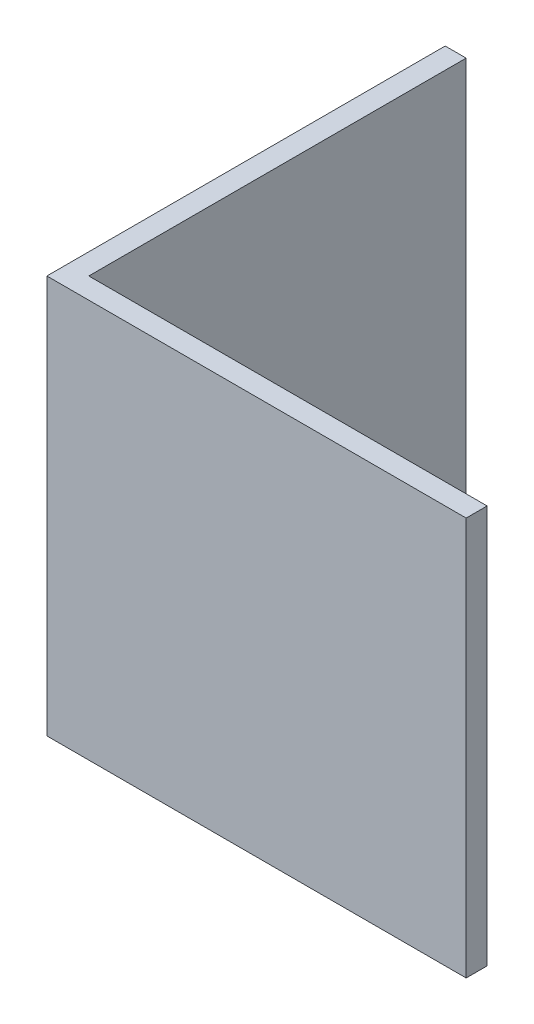
ISO-10303-21;
HEADER;
FILE_DESCRIPTION(('STEP AP214'),'2;1');
FILE_NAME('part.step','',(''),(''),'','','');
FILE_SCHEMA(('AUTOMOTIVE_DESIGN { 1 0 10303 214 1 1 1 1 }'));
ENDSEC;
DATA;
#1=APPLICATION_CONTEXT('core data for automotive mechanical design processes');
#2=APPLICATION_PROTOCOL_DEFINITION('international standard','automotive_design',2000,#1);
#3=PRODUCT_CONTEXT('',#1,'mechanical');
#4=PRODUCT('Part','Part','',(#3));
#5=PRODUCT_RELATED_PRODUCT_CATEGORY('part','',(#4));
#6=PRODUCT_DEFINITION_FORMATION('','',#4);
#7=PRODUCT_DEFINITION_CONTEXT('part definition',#1,'design');
#8=PRODUCT_DEFINITION('design','',#6,#7);
#9=PRODUCT_DEFINITION_SHAPE('','',#8);
#10=(LENGTH_UNIT() NAMED_UNIT(*) SI_UNIT(.MILLI.,.METRE.));
#11=(NAMED_UNIT(*) PLANE_ANGLE_UNIT() SI_UNIT($,.RADIAN.));
#12=(NAMED_UNIT(*) SI_UNIT($,.STERADIAN.) SOLID_ANGLE_UNIT());
#13=UNCERTAINTY_MEASURE_WITH_UNIT(LENGTH_MEASURE(1.E-05),#10,'distance_accuracy_value','');
#14=(GEOMETRIC_REPRESENTATION_CONTEXT(3) GLOBAL_UNCERTAINTY_ASSIGNED_CONTEXT((#13)) GLOBAL_UNIT_ASSIGNED_CONTEXT((#10,
#11,#12)) REPRESENTATION_CONTEXT('',''));
#15=CARTESIAN_POINT('',(0.,0.,0.));
#16=DIRECTION('',(0.,0.,1.));
#17=DIRECTION('',(1.,0.,0.));
#18=AXIS2_PLACEMENT_3D('',#15,#16,#17);
#19=CARTESIAN_POINT('',(0.999999999999998,19.,-20.));
#20=DIRECTION('',(-1.,0.,0.));
#21=DIRECTION('',(0.,0.,1.));
#22=AXIS2_PLACEMENT_3D('',#19,#20,#21);
#23=PLANE('',#22);
#24=DIRECTION('',(0.,-1.,0.));
#25=VECTOR('',#24,1.);
#26=CARTESIAN_POINT('',(0.999999999999998,19.,-19.));
#27=LINE('',#26,#25);
#28=CARTESIAN_POINT('',(0.999999999999998,19.,-19.));
#29=VERTEX_POINT('',#28);
#30=CARTESIAN_POINT('',(0.999999999999998,0.,-19.));
#31=VERTEX_POINT('',#30);
#32=EDGE_CURVE('E50',#29,#31,#27,.T.);
#33=ORIENTED_EDGE('',*,*,#32,.F.);
#34=DIRECTION('',(0.,0.,-1.));
#35=VECTOR('',#34,1.);
#36=CARTESIAN_POINT('',(0.999999999999998,19.,-20.));
#37=LINE('',#36,#35);
#38=CARTESIAN_POINT('',(1.,19.,-0.999999999999997));
#39=VERTEX_POINT('',#38);
#40=EDGE_CURVE('E133',#39,#29,#37,.T.);
#41=ORIENTED_EDGE('',*,*,#40,.F.);
#42=DIRECTION('',(0.,-1.,0.));
#43=VECTOR('',#42,1.);
#44=CARTESIAN_POINT('',(1.,19.,-0.999999999999997));
#45=LINE('',#44,#43);
#46=CARTESIAN_POINT('',(1.,0.,-0.999999999999997));
#47=VERTEX_POINT('',#46);
#48=EDGE_CURVE('E119',#39,#47,#45,.T.);
#49=ORIENTED_EDGE('',*,*,#48,.T.);
#50=DIRECTION('',(0.,0.,-1.));
#51=VECTOR('',#50,1.);
#52=CARTESIAN_POINT('',(0.999999999999998,0.,-20.));
#53=LINE('',#52,#51);
#54=EDGE_CURVE('E110',#47,#31,#53,.T.);
#55=ORIENTED_EDGE('',*,*,#54,.T.);
#56=EDGE_LOOP('',(#33,#41,#49,#55));
#57=FACE_BOUND('',#56,.T.);
#58=ADVANCED_FACE('F35',(#57),#23,.F.);
#59=CARTESIAN_POINT('',(0.,19.,0.));
#60=DIRECTION('',(1.,0.,0.));
#61=DIRECTION('',(0.,0.,-1.));
#62=AXIS2_PLACEMENT_3D('',#59,#60,#61);
#63=PLANE('',#62);
#64=DIRECTION('',(0.,1.,0.));
#65=VECTOR('',#64,1.);
#66=CARTESIAN_POINT('',(0.,0.,-19.));
#67=LINE('',#66,#65);
#68=CARTESIAN_POINT('',(0.,0.,-19.));
#69=VERTEX_POINT('',#68);
#70=CARTESIAN_POINT('',(0.,19.,-19.));
#71=VERTEX_POINT('',#70);
#72=EDGE_CURVE('E97',#69,#71,#67,.T.);
#73=ORIENTED_EDGE('',*,*,#72,.F.);
#74=DIRECTION('',(0.,0.,1.));
#75=VECTOR('',#74,1.);
#76=CARTESIAN_POINT('',(0.,0.,0.));
#77=LINE('',#76,#75);
#78=CARTESIAN_POINT('',(0.,0.,0.));
#79=VERTEX_POINT('',#78);
#80=EDGE_CURVE('E81',#69,#79,#77,.T.);
#81=ORIENTED_EDGE('',*,*,#80,.T.);
#82=DIRECTION('',(0.,-1.,0.));
#83=VECTOR('',#82,1.);
#84=CARTESIAN_POINT('',(0.,19.,0.));
#85=LINE('',#84,#83);
#86=CARTESIAN_POINT('',(0.,19.,0.));
#87=VERTEX_POINT('',#86);
#88=EDGE_CURVE('E117',#87,#79,#85,.T.);
#89=ORIENTED_EDGE('',*,*,#88,.F.);
#90=DIRECTION('',(0.,0.,1.));
#91=VECTOR('',#90,1.);
#92=CARTESIAN_POINT('',(0.,19.,0.));
#93=LINE('',#92,#91);
#94=EDGE_CURVE('E59',#71,#87,#93,.T.);
#95=ORIENTED_EDGE('',*,*,#94,.F.);
#96=EDGE_LOOP('',(#73,#81,#89,#95));
#97=FACE_BOUND('',#96,.T.);
#98=ADVANCED_FACE('F102',(#97),#63,.F.);
#99=CARTESIAN_POINT('',(0.,19.,0.));
#100=DIRECTION('',(0.,-1.,0.));
#101=DIRECTION('',(0.,0.,-1.));
#102=AXIS2_PLACEMENT_3D('',#99,#100,#101);
#103=PLANE('',#102);
#104=DIRECTION('',(1.,0.,0.));
#105=VECTOR('',#104,1.);
#106=CARTESIAN_POINT('',(0.,19.,-19.));
#107=LINE('',#106,#105);
#108=EDGE_CURVE('E103',#71,#29,#107,.T.);
#109=ORIENTED_EDGE('',*,*,#108,.F.);
#110=ORIENTED_EDGE('',*,*,#94,.T.);
#111=DIRECTION('',(1.,0.,0.));
#112=VECTOR('',#111,1.);
#113=CARTESIAN_POINT('',(20.,19.,0.));
#114=LINE('',#113,#112);
#115=CARTESIAN_POINT('',(20.,19.,0.));
#116=VERTEX_POINT('',#115);
#117=EDGE_CURVE('E109',#87,#116,#114,.T.);
#118=ORIENTED_EDGE('',*,*,#117,.T.);
#119=DIRECTION('',(0.,0.,-1.));
#120=VECTOR('',#119,1.);
#121=CARTESIAN_POINT('',(20.,19.,-0.999999999999998));
#122=LINE('',#121,#120);
#123=CARTESIAN_POINT('',(20.,19.,-0.999999999999998));
#124=VERTEX_POINT('',#123);
#125=EDGE_CURVE('E88',#116,#124,#122,.T.);
#126=ORIENTED_EDGE('',*,*,#125,.T.);
#127=DIRECTION('',(-1.,0.,0.));
#128=VECTOR('',#127,1.);
#129=CARTESIAN_POINT('',(1.,19.,-0.999999999999997));
#130=LINE('',#129,#128);
#131=EDGE_CURVE('E127',#124,#39,#130,.T.);
#132=ORIENTED_EDGE('',*,*,#131,.T.);
#133=ORIENTED_EDGE('',*,*,#40,.T.);
#134=EDGE_LOOP('',(#109,#110,#118,#126,#132,#133));
#135=FACE_BOUND('',#134,.T.);
#136=ADVANCED_FACE('F141',(#135),#103,.F.);
#137=CARTESIAN_POINT('',(0.,0.,0.));
#138=DIRECTION('',(0.,-1.,0.));
#139=DIRECTION('',(0.,0.,-1.));
#140=AXIS2_PLACEMENT_3D('',#137,#138,#139);
#141=PLANE('',#140);
#142=ORIENTED_EDGE('',*,*,#80,.F.);
#143=DIRECTION('',(-1.,0.,0.));
#144=VECTOR('',#143,1.);
#145=CARTESIAN_POINT('',(0.999999999999998,0.,-19.));
#146=LINE('',#145,#144);
#147=EDGE_CURVE('E95',#31,#69,#146,.T.);
#148=ORIENTED_EDGE('',*,*,#147,.F.);
#149=ORIENTED_EDGE('',*,*,#54,.F.);
#150=DIRECTION('',(-1.,0.,0.));
#151=VECTOR('',#150,1.);
#152=CARTESIAN_POINT('',(1.,0.,-0.999999999999997));
#153=LINE('',#152,#151);
#154=CARTESIAN_POINT('',(20.,0.,-0.999999999999998));
#155=VERTEX_POINT('',#154);
#156=EDGE_CURVE('E113',#155,#47,#153,.T.);
#157=ORIENTED_EDGE('',*,*,#156,.F.);
#158=DIRECTION('',(0.,0.,-1.));
#159=VECTOR('',#158,1.);
#160=CARTESIAN_POINT('',(20.,0.,-0.999999999999998));
#161=LINE('',#160,#159);
#162=CARTESIAN_POINT('',(20.,0.,0.));
#163=VERTEX_POINT('',#162);
#164=EDGE_CURVE('E128',#163,#155,#161,.T.);
#165=ORIENTED_EDGE('',*,*,#164,.F.);
#166=DIRECTION('',(1.,0.,0.));
#167=VECTOR('',#166,1.);
#168=CARTESIAN_POINT('',(20.,0.,0.));
#169=LINE('',#168,#167);
#170=EDGE_CURVE('E108',#79,#163,#169,.T.);
#171=ORIENTED_EDGE('',*,*,#170,.F.);
#172=EDGE_LOOP('',(#142,#148,#149,#157,#165,#171));
#173=FACE_BOUND('',#172,.T.);
#174=ADVANCED_FACE('F106',(#173),#141,.T.);
#175=CARTESIAN_POINT('',(20.,19.,0.));
#176=DIRECTION('',(0.,0.,-1.));
#177=DIRECTION('',(-1.,0.,0.));
#178=AXIS2_PLACEMENT_3D('',#175,#176,#177);
#179=PLANE('',#178);
#180=ORIENTED_EDGE('',*,*,#170,.T.);
#181=DIRECTION('',(0.,-1.,0.));
#182=VECTOR('',#181,1.);
#183=CARTESIAN_POINT('',(20.,19.,0.));
#184=LINE('',#183,#182);
#185=EDGE_CURVE('E11',#116,#163,#184,.T.);
#186=ORIENTED_EDGE('',*,*,#185,.F.);
#187=ORIENTED_EDGE('',*,*,#117,.F.);
#188=ORIENTED_EDGE('',*,*,#88,.T.);
#189=EDGE_LOOP('',(#180,#186,#187,#188));
#190=FACE_BOUND('',#189,.T.);
#191=ADVANCED_FACE('F37',(#190),#179,.F.);
#192=CARTESIAN_POINT('',(20.,19.,-0.999999999999998));
#193=DIRECTION('',(-1.,0.,0.));
#194=DIRECTION('',(0.,0.,1.));
#195=AXIS2_PLACEMENT_3D('',#192,#193,#194);
#196=PLANE('',#195);
#197=ORIENTED_EDGE('',*,*,#164,.T.);
#198=DIRECTION('',(0.,-1.,0.));
#199=VECTOR('',#198,1.);
#200=CARTESIAN_POINT('',(20.,19.,-0.999999999999998));
#201=LINE('',#200,#199);
#202=EDGE_CURVE('E43',#124,#155,#201,.T.);
#203=ORIENTED_EDGE('',*,*,#202,.F.);
#204=ORIENTED_EDGE('',*,*,#125,.F.);
#205=ORIENTED_EDGE('',*,*,#185,.T.);
#206=EDGE_LOOP('',(#197,#203,#204,#205));
#207=FACE_BOUND('',#206,.T.);
#208=ADVANCED_FACE('F145',(#207),#196,.F.);
#209=CARTESIAN_POINT('',(1.,19.,-0.999999999999997));
#210=DIRECTION('',(0.,0.,1.));
#211=DIRECTION('',(1.,0.,0.));
#212=AXIS2_PLACEMENT_3D('',#209,#210,#211);
#213=PLANE('',#212);
#214=ORIENTED_EDGE('',*,*,#156,.T.);
#215=ORIENTED_EDGE('',*,*,#48,.F.);
#216=ORIENTED_EDGE('',*,*,#131,.F.);
#217=ORIENTED_EDGE('',*,*,#202,.T.);
#218=EDGE_LOOP('',(#214,#215,#216,#217));
#219=FACE_BOUND('',#218,.T.);
#220=ADVANCED_FACE('F125',(#219),#213,.F.);
#221=CARTESIAN_POINT('',(0.,0.,-19.));
#222=DIRECTION('',(0.,0.,-1.));
#223=DIRECTION('',(-1.,0.,0.));
#224=AXIS2_PLACEMENT_3D('',#221,#222,#223);
#225=PLANE('',#224);
#226=ORIENTED_EDGE('',*,*,#32,.T.);
#227=ORIENTED_EDGE('',*,*,#147,.T.);
#228=ORIENTED_EDGE('',*,*,#72,.T.);
#229=ORIENTED_EDGE('',*,*,#108,.T.);
#230=EDGE_LOOP('',(#226,#227,#228,#229));
#231=FACE_BOUND('',#230,.T.);
#232=ADVANCED_FACE('F96',(#231),#225,.T.);
#233=CLOSED_SHELL('',(#58,#98,#136,#174,#191,#208,#220,#232));
#234=MANIFOLD_SOLID_BREP('B2',#233);
#235=ADVANCED_BREP_SHAPE_REPRESENTATION('',(#18,#234),#14);
#236=SHAPE_DEFINITION_REPRESENTATION(#9,#235);
ENDSEC;
END-ISO-10303-21;
